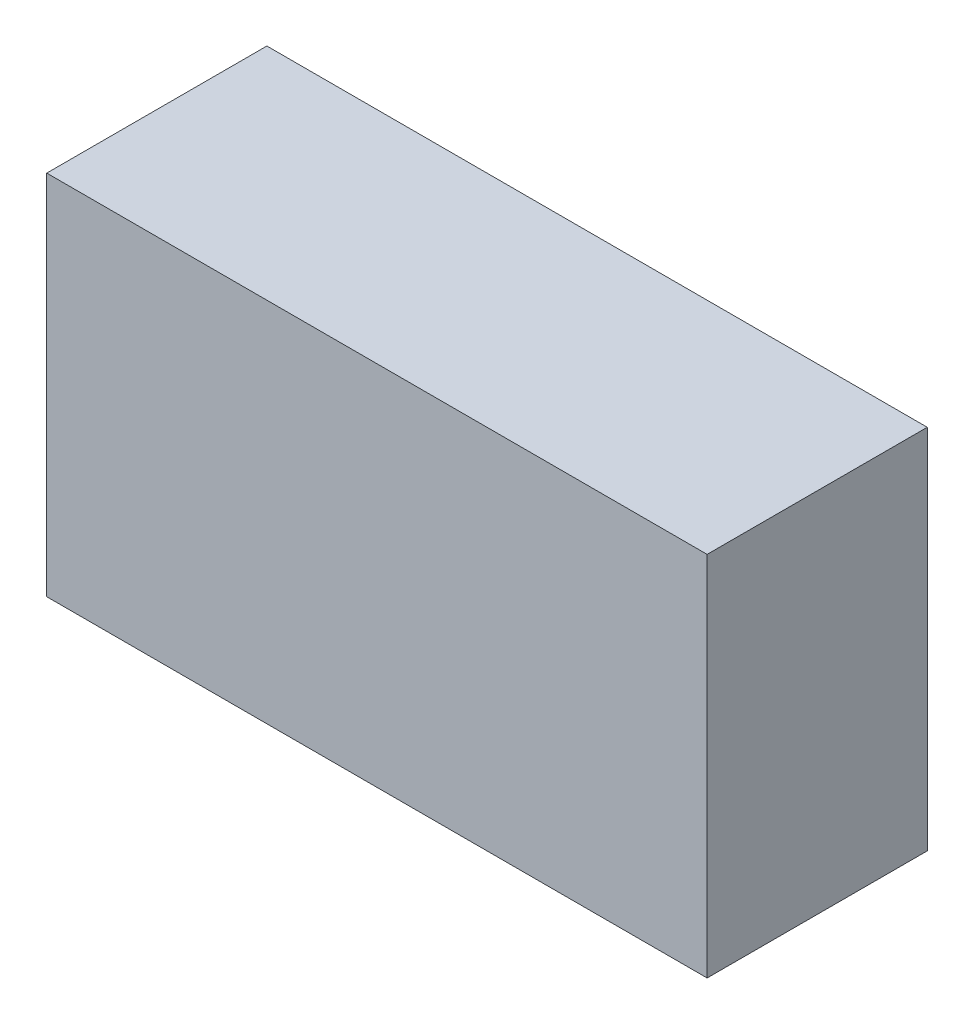
ISO-10303-21;
HEADER;
FILE_DESCRIPTION(('STEP AP214'),'2;1');
FILE_NAME('part.step','',(''),(''),'','','');
FILE_SCHEMA(('AUTOMOTIVE_DESIGN { 1 0 10303 214 1 1 1 1 }'));
ENDSEC;
DATA;
#1=APPLICATION_CONTEXT('core data for automotive mechanical design processes');
#2=APPLICATION_PROTOCOL_DEFINITION('international standard','automotive_design',2000,#1);
#3=PRODUCT_CONTEXT('',#1,'mechanical');
#4=PRODUCT('Part','Part','',(#3));
#5=PRODUCT_RELATED_PRODUCT_CATEGORY('part','',(#4));
#6=PRODUCT_DEFINITION_FORMATION('','',#4);
#7=PRODUCT_DEFINITION_CONTEXT('part definition',#1,'design');
#8=PRODUCT_DEFINITION('design','',#6,#7);
#9=PRODUCT_DEFINITION_SHAPE('','',#8);
#10=(LENGTH_UNIT() NAMED_UNIT(*) SI_UNIT(.MILLI.,.METRE.));
#11=(NAMED_UNIT(*) PLANE_ANGLE_UNIT() SI_UNIT($,.RADIAN.));
#12=(NAMED_UNIT(*) SI_UNIT($,.STERADIAN.) SOLID_ANGLE_UNIT());
#13=UNCERTAINTY_MEASURE_WITH_UNIT(LENGTH_MEASURE(1.E-05),#10,'distance_accuracy_value','');
#14=(GEOMETRIC_REPRESENTATION_CONTEXT(3) GLOBAL_UNCERTAINTY_ASSIGNED_CONTEXT((#13)) GLOBAL_UNIT_ASSIGNED_CONTEXT((#10,
#11,#12)) REPRESENTATION_CONTEXT('',''));
#15=CARTESIAN_POINT('',(0.,0.,0.));
#16=DIRECTION('',(0.,0.,1.));
#17=DIRECTION('',(1.,0.,0.));
#18=AXIS2_PLACEMENT_3D('',#15,#16,#17);
#19=CARTESIAN_POINT('',(0.45,-0.25,0.));
#20=DIRECTION('',(1.,0.,0.));
#21=DIRECTION('',(0.,1.,0.));
#22=AXIS2_PLACEMENT_3D('',#19,#20,#21);
#23=PLANE('',#22);
#24=DIRECTION('',(0.,-1.,0.));
#25=VECTOR('',#24,1.);
#26=CARTESIAN_POINT('',(0.45,0.25,0.));
#27=LINE('',#26,#25);
#28=CARTESIAN_POINT('',(0.45,0.25,0.));
#29=VERTEX_POINT('',#28);
#30=CARTESIAN_POINT('',(0.45,-0.25,0.));
#31=VERTEX_POINT('',#30);
#32=EDGE_CURVE('E11',#29,#31,#27,.T.);
#33=ORIENTED_EDGE('',*,*,#32,.F.);
#34=DIRECTION('',(0.,0.,1.));
#35=VECTOR('',#34,1.);
#36=CARTESIAN_POINT('',(0.45,0.25,0.));
#37=LINE('',#36,#35);
#38=CARTESIAN_POINT('',(0.45,0.25,0.3));
#39=VERTEX_POINT('',#38);
#40=EDGE_CURVE('E24',#29,#39,#37,.T.);
#41=ORIENTED_EDGE('',*,*,#40,.T.);
#42=DIRECTION('',(0.,1.,0.));
#43=VECTOR('',#42,1.);
#44=CARTESIAN_POINT('',(0.45,0.25,0.3));
#45=LINE('',#44,#43);
#46=CARTESIAN_POINT('',(0.45,-0.25,0.3));
#47=VERTEX_POINT('',#46);
#48=EDGE_CURVE('E75',#47,#39,#45,.T.);
#49=ORIENTED_EDGE('',*,*,#48,.F.);
#50=DIRECTION('',(0.,0.,1.));
#51=VECTOR('',#50,1.);
#52=CARTESIAN_POINT('',(0.45,-0.25,0.));
#53=LINE('',#52,#51);
#54=EDGE_CURVE('E85',#31,#47,#53,.T.);
#55=ORIENTED_EDGE('',*,*,#54,.F.);
#56=EDGE_LOOP('',(#33,#41,#49,#55));
#57=FACE_BOUND('',#56,.T.);
#58=ADVANCED_FACE('F17',(#57),#23,.T.);
#59=CARTESIAN_POINT('',(-0.45,-0.25,0.));
#60=DIRECTION('',(0.,-1.,0.));
#61=DIRECTION('',(1.,0.,0.));
#62=AXIS2_PLACEMENT_3D('',#59,#60,#61);
#63=PLANE('',#62);
#64=DIRECTION('',(-1.,0.,0.));
#65=VECTOR('',#64,1.);
#66=CARTESIAN_POINT('',(0.45,-0.25,0.));
#67=LINE('',#66,#65);
#68=CARTESIAN_POINT('',(-0.45,-0.25,0.));
#69=VERTEX_POINT('',#68);
#70=EDGE_CURVE('E83',#31,#69,#67,.T.);
#71=ORIENTED_EDGE('',*,*,#70,.F.);
#72=ORIENTED_EDGE('',*,*,#54,.T.);
#73=DIRECTION('',(1.,0.,0.));
#74=VECTOR('',#73,1.);
#75=CARTESIAN_POINT('',(0.45,-0.25,0.3));
#76=LINE('',#75,#74);
#77=CARTESIAN_POINT('',(-0.45,-0.25,0.3));
#78=VERTEX_POINT('',#77);
#79=EDGE_CURVE('E81',#78,#47,#76,.T.);
#80=ORIENTED_EDGE('',*,*,#79,.F.);
#81=DIRECTION('',(0.,0.,1.));
#82=VECTOR('',#81,1.);
#83=CARTESIAN_POINT('',(-0.45,-0.25,0.));
#84=LINE('',#83,#82);
#85=EDGE_CURVE('E61',#69,#78,#84,.T.);
#86=ORIENTED_EDGE('',*,*,#85,.F.);
#87=EDGE_LOOP('',(#71,#72,#80,#86));
#88=FACE_BOUND('',#87,.T.);
#89=ADVANCED_FACE('F91',(#88),#63,.T.);
#90=CARTESIAN_POINT('',(-0.45,0.25,0.));
#91=DIRECTION('',(-1.,0.,0.));
#92=DIRECTION('',(0.,-1.,0.));
#93=AXIS2_PLACEMENT_3D('',#90,#91,#92);
#94=PLANE('',#93);
#95=DIRECTION('',(0.,1.,0.));
#96=VECTOR('',#95,1.);
#97=CARTESIAN_POINT('',(-0.45,-0.25,0.));
#98=LINE('',#97,#96);
#99=CARTESIAN_POINT('',(-0.45,0.25,0.));
#100=VERTEX_POINT('',#99);
#101=EDGE_CURVE('E65',#69,#100,#98,.T.);
#102=ORIENTED_EDGE('',*,*,#101,.F.);
#103=ORIENTED_EDGE('',*,*,#85,.T.);
#104=DIRECTION('',(0.,-1.,0.));
#105=VECTOR('',#104,1.);
#106=CARTESIAN_POINT('',(-0.45,-0.25,0.3));
#107=LINE('',#106,#105);
#108=CARTESIAN_POINT('',(-0.45,0.25,0.3));
#109=VERTEX_POINT('',#108);
#110=EDGE_CURVE('E54',#109,#78,#107,.T.);
#111=ORIENTED_EDGE('',*,*,#110,.F.);
#112=DIRECTION('',(0.,0.,1.));
#113=VECTOR('',#112,1.);
#114=CARTESIAN_POINT('',(-0.45,0.25,0.));
#115=LINE('',#114,#113);
#116=EDGE_CURVE('E58',#100,#109,#115,.T.);
#117=ORIENTED_EDGE('',*,*,#116,.F.);
#118=EDGE_LOOP('',(#102,#103,#111,#117));
#119=FACE_BOUND('',#118,.T.);
#120=ADVANCED_FACE('F57',(#119),#94,.T.);
#121=CARTESIAN_POINT('',(0.45,0.25,0.));
#122=DIRECTION('',(0.,1.,0.));
#123=DIRECTION('',(-1.,0.,0.));
#124=AXIS2_PLACEMENT_3D('',#121,#122,#123);
#125=PLANE('',#124);
#126=DIRECTION('',(1.,0.,0.));
#127=VECTOR('',#126,1.);
#128=CARTESIAN_POINT('',(-0.45,0.25,0.));
#129=LINE('',#128,#127);
#130=EDGE_CURVE('E71',#100,#29,#129,.T.);
#131=ORIENTED_EDGE('',*,*,#130,.F.);
#132=ORIENTED_EDGE('',*,*,#116,.T.);
#133=DIRECTION('',(-1.,0.,0.));
#134=VECTOR('',#133,1.);
#135=CARTESIAN_POINT('',(-0.45,0.25,0.3));
#136=LINE('',#135,#134);
#137=EDGE_CURVE('E70',#39,#109,#136,.T.);
#138=ORIENTED_EDGE('',*,*,#137,.F.);
#139=ORIENTED_EDGE('',*,*,#40,.F.);
#140=EDGE_LOOP('',(#131,#132,#138,#139));
#141=FACE_BOUND('',#140,.T.);
#142=ADVANCED_FACE('F69',(#141),#125,.T.);
#143=CARTESIAN_POINT('',(0.,0.,0.));
#144=DIRECTION('',(0.,0.,1.));
#145=DIRECTION('',(1.,0.,0.));
#146=AXIS2_PLACEMENT_3D('',#143,#144,#145);
#147=PLANE('',#146);
#148=ORIENTED_EDGE('',*,*,#130,.T.);
#149=ORIENTED_EDGE('',*,*,#32,.T.);
#150=ORIENTED_EDGE('',*,*,#70,.T.);
#151=ORIENTED_EDGE('',*,*,#101,.T.);
#152=EDGE_LOOP('',(#148,#149,#150,#151));
#153=FACE_BOUND('',#152,.T.);
#154=ADVANCED_FACE('F88',(#153),#147,.F.);
#155=CARTESIAN_POINT('',(0.,0.,0.3));
#156=DIRECTION('',(0.,0.,1.));
#157=DIRECTION('',(1.,0.,0.));
#158=AXIS2_PLACEMENT_3D('',#155,#156,#157);
#159=PLANE('',#158);
#160=ORIENTED_EDGE('',*,*,#137,.T.);
#161=ORIENTED_EDGE('',*,*,#110,.T.);
#162=ORIENTED_EDGE('',*,*,#79,.T.);
#163=ORIENTED_EDGE('',*,*,#48,.T.);
#164=EDGE_LOOP('',(#160,#161,#162,#163));
#165=FACE_BOUND('',#164,.T.);
#166=ADVANCED_FACE('F74',(#165),#159,.T.);
#167=CLOSED_SHELL('',(#58,#89,#120,#142,#154,#166));
#168=MANIFOLD_SOLID_BREP('B1',#167);
#169=ADVANCED_BREP_SHAPE_REPRESENTATION('',(#18,#168),#14);
#170=SHAPE_DEFINITION_REPRESENTATION(#9,#169);
ENDSEC;
END-ISO-10303-21;
